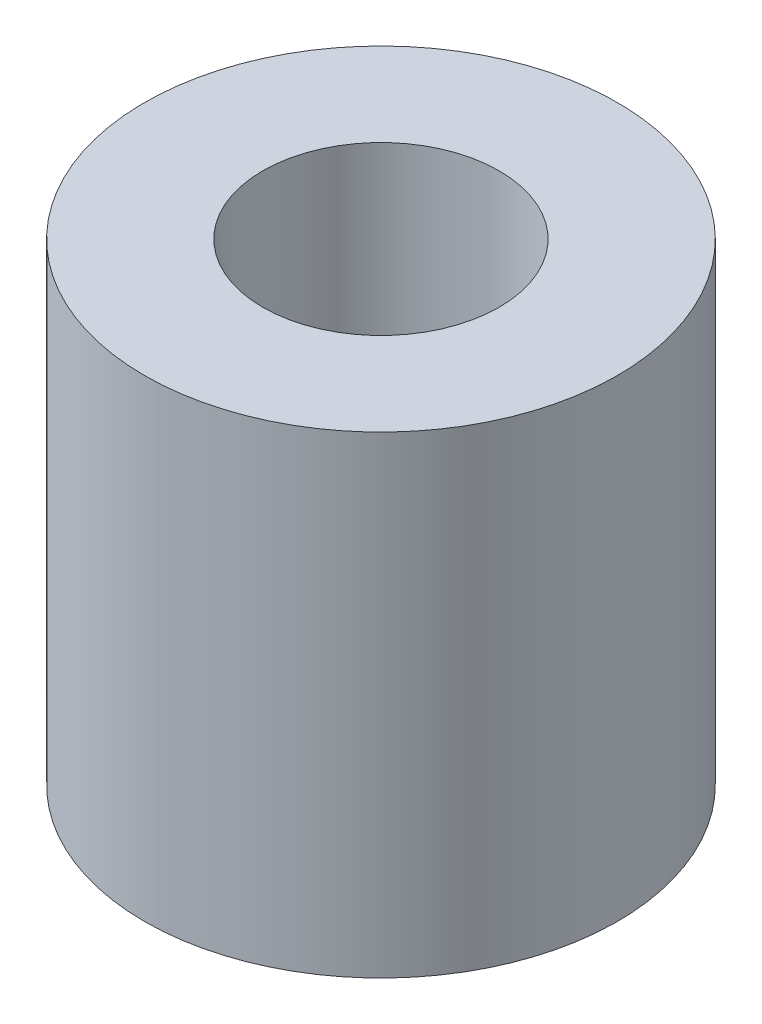
ISO-10303-21;
HEADER;
FILE_DESCRIPTION(('STEP AP214'),'2;1');
FILE_NAME('part.step','',(''),(''),'','','');
FILE_SCHEMA(('AUTOMOTIVE_DESIGN { 1 0 10303 214 1 1 1 1 }'));
ENDSEC;
DATA;
#1=APPLICATION_CONTEXT('core data for automotive mechanical design processes');
#2=APPLICATION_PROTOCOL_DEFINITION('international standard','automotive_design',2000,#1);
#3=PRODUCT_CONTEXT('',#1,'mechanical');
#4=PRODUCT('Part','Part','',(#3));
#5=PRODUCT_RELATED_PRODUCT_CATEGORY('part','',(#4));
#6=PRODUCT_DEFINITION_FORMATION('','',#4);
#7=PRODUCT_DEFINITION_CONTEXT('part definition',#1,'design');
#8=PRODUCT_DEFINITION('design','',#6,#7);
#9=PRODUCT_DEFINITION_SHAPE('','',#8);
#10=(LENGTH_UNIT() NAMED_UNIT(*) SI_UNIT(.MILLI.,.METRE.));
#11=(NAMED_UNIT(*) PLANE_ANGLE_UNIT() SI_UNIT($,.RADIAN.));
#12=(NAMED_UNIT(*) SI_UNIT($,.STERADIAN.) SOLID_ANGLE_UNIT());
#13=UNCERTAINTY_MEASURE_WITH_UNIT(LENGTH_MEASURE(1.E-05),#10,'distance_accuracy_value','');
#14=(GEOMETRIC_REPRESENTATION_CONTEXT(3) GLOBAL_UNCERTAINTY_ASSIGNED_CONTEXT((#13)) GLOBAL_UNIT_ASSIGNED_CONTEXT((#10,
#11,#12)) REPRESENTATION_CONTEXT('',''));
#15=CARTESIAN_POINT('',(0.,0.,0.));
#16=DIRECTION('',(0.,0.,1.));
#17=DIRECTION('',(1.,0.,0.));
#18=AXIS2_PLACEMENT_3D('',#15,#16,#17);
#19=CARTESIAN_POINT('',(0.,12.,0.));
#20=DIRECTION('',(0.,1.,0.));
#21=DIRECTION('',(0.,0.,1.));
#22=AXIS2_PLACEMENT_3D('',#19,#20,#21);
#23=PLANE('',#22);
#24=CARTESIAN_POINT('',(0.,12.,0.));
#25=DIRECTION('',(0.,1.,0.));
#26=DIRECTION('',(0.,0.,1.));
#27=AXIS2_PLACEMENT_3D('',#24,#25,#26);
#28=CIRCLE('',#27,6.);
#29=CARTESIAN_POINT('',(0.,12.,6.));
#30=VERTEX_POINT('',#29);
#31=EDGE_CURVE('E11',#30,#30,#28,.T.);
#32=ORIENTED_EDGE('',*,*,#31,.T.);
#33=EDGE_LOOP('',(#32));
#34=FACE_BOUND('',#33,.T.);
#35=CARTESIAN_POINT('',(0.,12.,0.));
#36=DIRECTION('',(0.,1.,0.));
#37=DIRECTION('',(0.,0.,1.));
#38=AXIS2_PLACEMENT_3D('',#35,#36,#37);
#39=CIRCLE('',#38,3.);
#40=CARTESIAN_POINT('',(0.,12.,3.));
#41=VERTEX_POINT('',#40);
#42=EDGE_CURVE('E47',#41,#41,#39,.T.);
#43=ORIENTED_EDGE('',*,*,#42,.F.);
#44=EDGE_LOOP('',(#43));
#45=FACE_BOUND('',#44,.T.);
#46=ADVANCED_FACE('F36',(#34,#45),#23,.T.);
#47=CARTESIAN_POINT('',(0.,0.,0.));
#48=DIRECTION('',(0.,1.,0.));
#49=DIRECTION('',(0.,0.,1.));
#50=AXIS2_PLACEMENT_3D('',#47,#48,#49);
#51=PLANE('',#50);
#52=CARTESIAN_POINT('',(0.,0.,0.));
#53=DIRECTION('',(0.,1.,0.));
#54=DIRECTION('',(0.,0.,1.));
#55=AXIS2_PLACEMENT_3D('',#52,#53,#54);
#56=CIRCLE('',#55,6.);
#57=CARTESIAN_POINT('',(0.,0.,6.));
#58=VERTEX_POINT('',#57);
#59=EDGE_CURVE('E40',#58,#58,#56,.T.);
#60=ORIENTED_EDGE('',*,*,#59,.F.);
#61=EDGE_LOOP('',(#60));
#62=FACE_BOUND('',#61,.T.);
#63=CARTESIAN_POINT('',(0.,0.,0.));
#64=DIRECTION('',(0.,1.,0.));
#65=DIRECTION('',(0.,0.,1.));
#66=AXIS2_PLACEMENT_3D('',#63,#64,#65);
#67=CIRCLE('',#66,3.);
#68=CARTESIAN_POINT('',(0.,0.,3.));
#69=VERTEX_POINT('',#68);
#70=EDGE_CURVE('E49',#69,#69,#67,.T.);
#71=ORIENTED_EDGE('',*,*,#70,.T.);
#72=EDGE_LOOP('',(#71));
#73=FACE_BOUND('',#72,.T.);
#74=ADVANCED_FACE('F59',(#62,#73),#51,.F.);
#75=CARTESIAN_POINT('',(0.,12.,0.));
#76=DIRECTION('',(0.,-1.,0.));
#77=DIRECTION('',(0.,0.,-1.));
#78=AXIS2_PLACEMENT_3D('',#75,#76,#77);
#79=CYLINDRICAL_SURFACE('',#78,6.);
#80=ORIENTED_EDGE('',*,*,#31,.F.);
#81=EDGE_LOOP('',(#80));
#82=FACE_BOUND('',#81,.T.);
#83=ORIENTED_EDGE('',*,*,#59,.T.);
#84=EDGE_LOOP('',(#83));
#85=FACE_BOUND('',#84,.T.);
#86=ADVANCED_FACE('F38',(#82,#85),#79,.T.);
#87=CARTESIAN_POINT('',(0.,12.,0.));
#88=DIRECTION('',(0.,-1.,0.));
#89=DIRECTION('',(0.,0.,-1.));
#90=AXIS2_PLACEMENT_3D('',#87,#88,#89);
#91=CYLINDRICAL_SURFACE('',#90,3.);
#92=ORIENTED_EDGE('',*,*,#42,.T.);
#93=EDGE_LOOP('',(#92));
#94=FACE_BOUND('',#93,.T.);
#95=ORIENTED_EDGE('',*,*,#70,.F.);
#96=EDGE_LOOP('',(#95));
#97=FACE_BOUND('',#96,.T.);
#98=ADVANCED_FACE('F55',(#94,#97),#91,.F.);
#99=CLOSED_SHELL('',(#46,#74,#86,#98));
#100=MANIFOLD_SOLID_BREP('B2',#99);
#101=ADVANCED_BREP_SHAPE_REPRESENTATION('',(#18,#100),#14);
#102=SHAPE_DEFINITION_REPRESENTATION(#9,#101);
ENDSEC;
END-ISO-10303-21;
